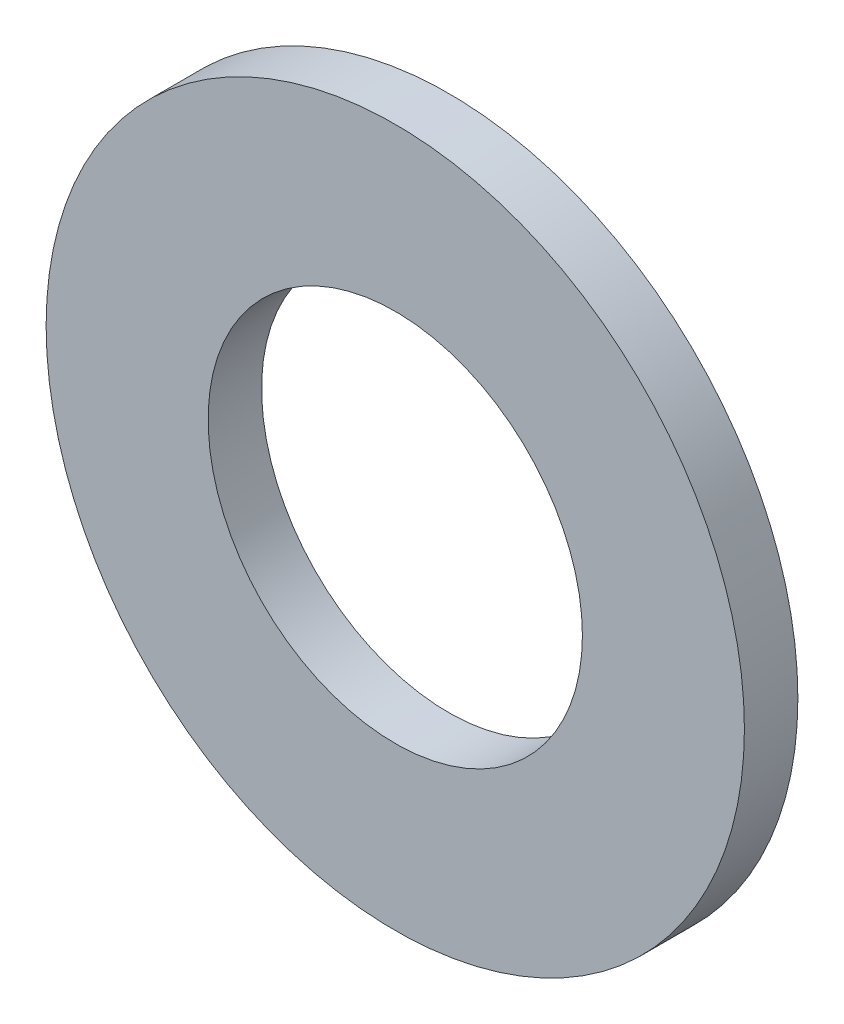
ISO-10303-21;
HEADER;
FILE_DESCRIPTION(('STEP AP214'),'2;1');
FILE_NAME('part.step','',(''),(''),'','','');
FILE_SCHEMA(('AUTOMOTIVE_DESIGN { 1 0 10303 214 1 1 1 1 }'));
ENDSEC;
DATA;
#1=APPLICATION_CONTEXT('core data for automotive mechanical design processes');
#2=APPLICATION_PROTOCOL_DEFINITION('international standard','automotive_design',2000,#1);
#3=PRODUCT_CONTEXT('',#1,'mechanical');
#4=PRODUCT('Part','Part','',(#3));
#5=PRODUCT_RELATED_PRODUCT_CATEGORY('part','',(#4));
#6=PRODUCT_DEFINITION_FORMATION('','',#4);
#7=PRODUCT_DEFINITION_CONTEXT('part definition',#1,'design');
#8=PRODUCT_DEFINITION('design','',#6,#7);
#9=PRODUCT_DEFINITION_SHAPE('','',#8);
#10=(LENGTH_UNIT() NAMED_UNIT(*) SI_UNIT(.MILLI.,.METRE.));
#11=(NAMED_UNIT(*) PLANE_ANGLE_UNIT() SI_UNIT($,.RADIAN.));
#12=(NAMED_UNIT(*) SI_UNIT($,.STERADIAN.) SOLID_ANGLE_UNIT());
#13=UNCERTAINTY_MEASURE_WITH_UNIT(LENGTH_MEASURE(1.E-05),#10,'distance_accuracy_value','');
#14=(GEOMETRIC_REPRESENTATION_CONTEXT(3) GLOBAL_UNCERTAINTY_ASSIGNED_CONTEXT((#13)) GLOBAL_UNIT_ASSIGNED_CONTEXT((#10,
#11,#12)) REPRESENTATION_CONTEXT('',''));
#15=CARTESIAN_POINT('',(0.,0.,0.));
#16=DIRECTION('',(0.,0.,1.));
#17=DIRECTION('',(1.,0.,0.));
#18=AXIS2_PLACEMENT_3D('',#15,#16,#17);
#19=CARTESIAN_POINT('',(0.,0.,3.4036));
#20=DIRECTION('',(0.,0.,1.));
#21=DIRECTION('',(1.,0.,0.));
#22=AXIS2_PLACEMENT_3D('',#19,#20,#21);
#23=PLANE('',#22);
#24=CARTESIAN_POINT('',(0.,0.,3.4036));
#25=DIRECTION('',(0.,0.,1.));
#26=DIRECTION('',(1.,0.,0.));
#27=AXIS2_PLACEMENT_3D('',#24,#25,#26);
#28=CIRCLE('',#27,22.225);
#29=CARTESIAN_POINT('',(22.225,0.,3.4036));
#30=VERTEX_POINT('',#29);
#31=EDGE_CURVE('E10',#30,#30,#28,.T.);
#32=ORIENTED_EDGE('',*,*,#31,.T.);
#33=EDGE_LOOP('',(#32));
#34=FACE_BOUND('',#33,.T.);
#35=CARTESIAN_POINT('',(0.,0.,3.4036));
#36=DIRECTION('',(0.,0.,1.));
#37=DIRECTION('',(1.,0.,0.));
#38=AXIS2_PLACEMENT_3D('',#35,#36,#37);
#39=CIRCLE('',#38,11.9126);
#40=CARTESIAN_POINT('',(11.9126,0.,3.4036));
#41=VERTEX_POINT('',#40);
#42=EDGE_CURVE('E39',#41,#41,#39,.T.);
#43=ORIENTED_EDGE('',*,*,#42,.F.);
#44=EDGE_LOOP('',(#43));
#45=FACE_BOUND('',#44,.T.);
#46=ADVANCED_FACE('F28',(#34,#45),#23,.T.);
#47=CARTESIAN_POINT('',(0.,0.,0.));
#48=DIRECTION('',(0.,0.,1.));
#49=DIRECTION('',(1.,0.,0.));
#50=AXIS2_PLACEMENT_3D('',#47,#48,#49);
#51=PLANE('',#50);
#52=CARTESIAN_POINT('',(0.,0.,0.));
#53=DIRECTION('',(0.,0.,1.));
#54=DIRECTION('',(1.,0.,0.));
#55=AXIS2_PLACEMENT_3D('',#52,#53,#54);
#56=CIRCLE('',#55,22.225);
#57=CARTESIAN_POINT('',(22.225,0.,0.));
#58=VERTEX_POINT('',#57);
#59=EDGE_CURVE('E35',#58,#58,#56,.T.);
#60=ORIENTED_EDGE('',*,*,#59,.F.);
#61=EDGE_LOOP('',(#60));
#62=FACE_BOUND('',#61,.T.);
#63=CARTESIAN_POINT('',(0.,0.,0.));
#64=DIRECTION('',(0.,0.,1.));
#65=DIRECTION('',(1.,0.,0.));
#66=AXIS2_PLACEMENT_3D('',#63,#64,#65);
#67=CIRCLE('',#66,11.9126);
#68=CARTESIAN_POINT('',(11.9126,0.,0.));
#69=VERTEX_POINT('',#68);
#70=EDGE_CURVE('E43',#69,#69,#67,.T.);
#71=ORIENTED_EDGE('',*,*,#70,.T.);
#72=EDGE_LOOP('',(#71));
#73=FACE_BOUND('',#72,.T.);
#74=ADVANCED_FACE('F49',(#62,#73),#51,.F.);
#75=CARTESIAN_POINT('',(0.,0.,3.4036));
#76=DIRECTION('',(0.,0.,-1.));
#77=DIRECTION('',(-1.,0.,0.));
#78=AXIS2_PLACEMENT_3D('',#75,#76,#77);
#79=CYLINDRICAL_SURFACE('',#78,22.225);
#80=ORIENTED_EDGE('',*,*,#31,.F.);
#81=EDGE_LOOP('',(#80));
#82=FACE_BOUND('',#81,.T.);
#83=ORIENTED_EDGE('',*,*,#59,.T.);
#84=EDGE_LOOP('',(#83));
#85=FACE_BOUND('',#84,.T.);
#86=ADVANCED_FACE('F30',(#82,#85),#79,.T.);
#87=CARTESIAN_POINT('',(0.,0.,3.4036));
#88=DIRECTION('',(0.,0.,-1.));
#89=DIRECTION('',(-1.,0.,0.));
#90=AXIS2_PLACEMENT_3D('',#87,#88,#89);
#91=CYLINDRICAL_SURFACE('',#90,11.9126);
#92=ORIENTED_EDGE('',*,*,#42,.T.);
#93=EDGE_LOOP('',(#92));
#94=FACE_BOUND('',#93,.T.);
#95=ORIENTED_EDGE('',*,*,#70,.F.);
#96=EDGE_LOOP('',(#95));
#97=FACE_BOUND('',#96,.T.);
#98=ADVANCED_FACE('F51',(#94,#97),#91,.F.);
#99=CLOSED_SHELL('',(#46,#74,#86,#98));
#100=MANIFOLD_SOLID_BREP('B2',#99);
#101=ADVANCED_BREP_SHAPE_REPRESENTATION('',(#18,#100),#14);
#102=SHAPE_DEFINITION_REPRESENTATION(#9,#101);
ENDSEC;
END-ISO-10303-21;
